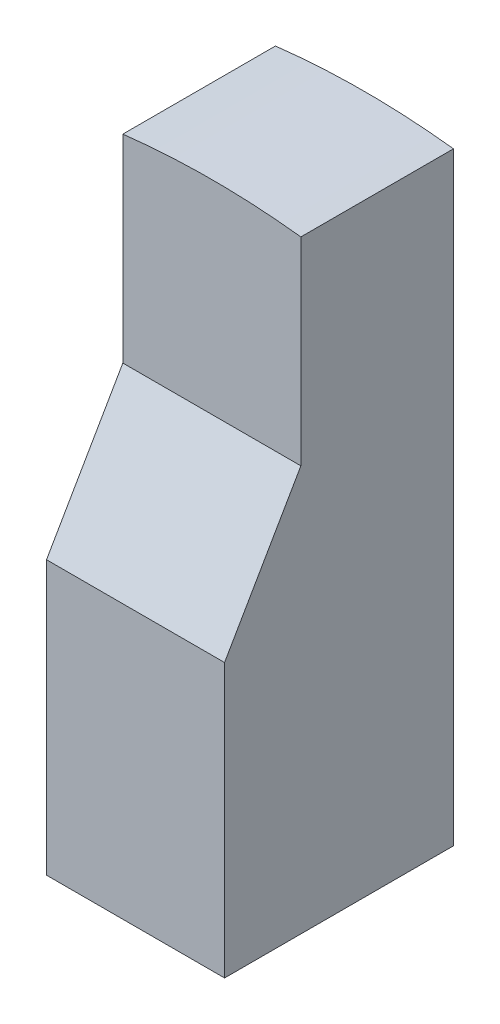
ISO-10303-21;
HEADER;
FILE_DESCRIPTION(('STEP AP214'),'2;1');
FILE_NAME('part.step','',(''),(''),'','','');
FILE_SCHEMA(('AUTOMOTIVE_DESIGN { 1 0 10303 214 1 1 1 1 }'));
ENDSEC;
DATA;
#1=APPLICATION_CONTEXT('core data for automotive mechanical design processes');
#2=APPLICATION_PROTOCOL_DEFINITION('international standard','automotive_design',2000,#1);
#3=PRODUCT_CONTEXT('',#1,'mechanical');
#4=PRODUCT('Part','Part','',(#3));
#5=PRODUCT_RELATED_PRODUCT_CATEGORY('part','',(#4));
#6=PRODUCT_DEFINITION_FORMATION('','',#4);
#7=PRODUCT_DEFINITION_CONTEXT('part definition',#1,'design');
#8=PRODUCT_DEFINITION('design','',#6,#7);
#9=PRODUCT_DEFINITION_SHAPE('','',#8);
#10=(LENGTH_UNIT() NAMED_UNIT(*) SI_UNIT(.MILLI.,.METRE.));
#11=(NAMED_UNIT(*) PLANE_ANGLE_UNIT() SI_UNIT($,.RADIAN.));
#12=(NAMED_UNIT(*) SI_UNIT($,.STERADIAN.) SOLID_ANGLE_UNIT());
#13=UNCERTAINTY_MEASURE_WITH_UNIT(LENGTH_MEASURE(1.E-05),#10,'distance_accuracy_value','');
#14=(GEOMETRIC_REPRESENTATION_CONTEXT(3) GLOBAL_UNCERTAINTY_ASSIGNED_CONTEXT((#13)) GLOBAL_UNIT_ASSIGNED_CONTEXT((#10,
#11,#12)) REPRESENTATION_CONTEXT('',''));
#15=CARTESIAN_POINT('',(0.,0.,0.));
#16=DIRECTION('',(0.,0.,1.));
#17=DIRECTION('',(1.,0.,0.));
#18=AXIS2_PLACEMENT_3D('',#15,#16,#17);
#19=CARTESIAN_POINT('',(0.,0.,22.5));
#20=DIRECTION('',(0.,0.,-1.));
#21=DIRECTION('',(-1.,0.,0.));
#22=AXIS2_PLACEMENT_3D('',#19,#20,#21);
#23=CYLINDRICAL_SURFACE('',#22,150.);
#24=CARTESIAN_POINT('',(0.,0.,7.49999999999998));
#25=DIRECTION('',(0.,0.,-1.));
#26=DIRECTION('',(0.,1.,0.));
#27=AXIS2_PLACEMENT_3D('',#24,#25,#26);
#28=CIRCLE('',#27,150.);
#29=CARTESIAN_POINT('',(-17.5,148.975669154396,7.5));
#30=VERTEX_POINT('',#29);
#31=CARTESIAN_POINT('',(17.5,148.975669154396,7.5));
#32=VERTEX_POINT('',#31);
#33=EDGE_CURVE('E83',#30,#32,#28,.T.);
#34=ORIENTED_EDGE('',*,*,#33,.T.);
#35=DIRECTION('',(0.,0.,-1.));
#36=VECTOR('',#35,1.);
#37=CARTESIAN_POINT('',(17.5,148.975669154396,22.5));
#38=LINE('',#37,#36);
#39=CARTESIAN_POINT('',(17.5,148.975669154396,-22.5));
#40=VERTEX_POINT('',#39);
#41=EDGE_CURVE('E76',#32,#40,#38,.T.);
#42=ORIENTED_EDGE('',*,*,#41,.T.);
#43=CARTESIAN_POINT('',(0.,0.,-22.5));
#44=DIRECTION('',(0.,0.,1.));
#45=DIRECTION('',(-1.,0.,0.));
#46=AXIS2_PLACEMENT_3D('',#43,#44,#45);
#47=CIRCLE('',#46,150.);
#48=CARTESIAN_POINT('',(-17.5,148.975669154396,-22.5));
#49=VERTEX_POINT('',#48);
#50=EDGE_CURVE('E80',#40,#49,#47,.T.);
#51=ORIENTED_EDGE('',*,*,#50,.T.);
#52=DIRECTION('',(0.,0.,-1.));
#53=VECTOR('',#52,1.);
#54=CARTESIAN_POINT('',(-17.5,148.975669154396,22.5));
#55=LINE('',#54,#53);
#56=EDGE_CURVE('E11',#30,#49,#55,.T.);
#57=ORIENTED_EDGE('',*,*,#56,.F.);
#58=EDGE_LOOP('',(#34,#42,#51,#57));
#59=FACE_BOUND('',#58,.T.);
#60=ADVANCED_FACE('F34',(#59),#23,.T.);
#61=CARTESIAN_POINT('',(-17.5,148.975669154396,22.5));
#62=DIRECTION('',(1.,0.,0.));
#63=DIRECTION('',(0.,1.,0.));
#64=AXIS2_PLACEMENT_3D('',#61,#62,#63);
#65=PLANE('',#64);
#66=DIRECTION('',(0.,0.866025403784442,-0.499999999999995));
#67=VECTOR('',#66,1.);
#68=CARTESIAN_POINT('',(-17.5,84.0192378864665,22.5));
#69=LINE('',#68,#67);
#70=CARTESIAN_POINT('',(-17.5,84.0192378864665,22.5));
#71=VERTEX_POINT('',#70);
#72=CARTESIAN_POINT('',(-17.5,110.,7.5));
#73=VERTEX_POINT('',#72);
#74=EDGE_CURVE('E48',#71,#73,#69,.T.);
#75=ORIENTED_EDGE('',*,*,#74,.T.);
#76=DIRECTION('',(0.,1.,0.));
#77=VECTOR('',#76,1.);
#78=CARTESIAN_POINT('',(-17.5,150.,7.5));
#79=LINE('',#78,#77);
#80=EDGE_CURVE('E120',#73,#30,#79,.T.);
#81=ORIENTED_EDGE('',*,*,#80,.T.);
#82=ORIENTED_EDGE('',*,*,#56,.T.);
#83=DIRECTION('',(0.,-1.,0.));
#84=VECTOR('',#83,1.);
#85=CARTESIAN_POINT('',(-17.5,148.975669154396,-22.5));
#86=LINE('',#85,#84);
#87=CARTESIAN_POINT('',(-17.5,30.31,-22.5));
#88=VERTEX_POINT('',#87);
#89=EDGE_CURVE('E102',#49,#88,#86,.T.);
#90=ORIENTED_EDGE('',*,*,#89,.T.);
#91=DIRECTION('',(0.,0.,-1.));
#92=VECTOR('',#91,1.);
#93=CARTESIAN_POINT('',(-17.5,30.31,22.5));
#94=LINE('',#93,#92);
#95=CARTESIAN_POINT('',(-17.5,30.31,22.5));
#96=VERTEX_POINT('',#95);
#97=EDGE_CURVE('E41',#96,#88,#94,.T.);
#98=ORIENTED_EDGE('',*,*,#97,.F.);
#99=DIRECTION('',(0.,-1.,0.));
#100=VECTOR('',#99,1.);
#101=CARTESIAN_POINT('',(-17.5,148.975669154396,22.5));
#102=LINE('',#101,#100);
#103=EDGE_CURVE('E97',#71,#96,#102,.T.);
#104=ORIENTED_EDGE('',*,*,#103,.F.);
#105=EDGE_LOOP('',(#75,#81,#82,#90,#98,#104));
#106=FACE_BOUND('',#105,.T.);
#107=ADVANCED_FACE('F117',(#106),#65,.F.);
#108=CARTESIAN_POINT('',(-17.5,30.31,22.5));
#109=DIRECTION('',(0.,1.,0.));
#110=DIRECTION('',(-1.,0.,0.));
#111=AXIS2_PLACEMENT_3D('',#108,#109,#110);
#112=PLANE('',#111);
#113=DIRECTION('',(1.,0.,0.));
#114=VECTOR('',#113,1.);
#115=CARTESIAN_POINT('',(-17.5,30.31,-22.5));
#116=LINE('',#115,#114);
#117=CARTESIAN_POINT('',(17.5,30.31,-22.5));
#118=VERTEX_POINT('',#117);
#119=EDGE_CURVE('E98',#88,#118,#116,.T.);
#120=ORIENTED_EDGE('',*,*,#119,.T.);
#121=DIRECTION('',(0.,0.,-1.));
#122=VECTOR('',#121,1.);
#123=CARTESIAN_POINT('',(17.5,30.31,22.5));
#124=LINE('',#123,#122);
#125=CARTESIAN_POINT('',(17.5,30.31,22.5));
#126=VERTEX_POINT('',#125);
#127=EDGE_CURVE('E87',#126,#118,#124,.T.);
#128=ORIENTED_EDGE('',*,*,#127,.F.);
#129=DIRECTION('',(1.,0.,0.));
#130=VECTOR('',#129,1.);
#131=CARTESIAN_POINT('',(-17.5,30.31,22.5));
#132=LINE('',#131,#130);
#133=EDGE_CURVE('E57',#96,#126,#132,.T.);
#134=ORIENTED_EDGE('',*,*,#133,.F.);
#135=ORIENTED_EDGE('',*,*,#97,.T.);
#136=EDGE_LOOP('',(#120,#128,#134,#135));
#137=FACE_BOUND('',#136,.T.);
#138=ADVANCED_FACE('F114',(#137),#112,.F.);
#139=CARTESIAN_POINT('',(17.5,148.975669154396,22.5));
#140=DIRECTION('',(-1.,0.,0.));
#141=DIRECTION('',(0.,-1.,0.));
#142=AXIS2_PLACEMENT_3D('',#139,#140,#141);
#143=PLANE('',#142);
#144=ORIENTED_EDGE('',*,*,#41,.F.);
#145=DIRECTION('',(0.,1.,0.));
#146=VECTOR('',#145,1.);
#147=CARTESIAN_POINT('',(17.5,150.,7.5));
#148=LINE('',#147,#146);
#149=CARTESIAN_POINT('',(17.5,110.,7.5));
#150=VERTEX_POINT('',#149);
#151=EDGE_CURVE('E138',#150,#32,#148,.T.);
#152=ORIENTED_EDGE('',*,*,#151,.F.);
#153=DIRECTION('',(0.,0.866025403784442,-0.499999999999995));
#154=VECTOR('',#153,1.);
#155=CARTESIAN_POINT('',(17.5,84.0192378864665,22.5));
#156=LINE('',#155,#154);
#157=CARTESIAN_POINT('',(17.5,84.0192378864665,22.5));
#158=VERTEX_POINT('',#157);
#159=EDGE_CURVE('E133',#158,#150,#156,.T.);
#160=ORIENTED_EDGE('',*,*,#159,.F.);
#161=DIRECTION('',(0.,1.,0.));
#162=VECTOR('',#161,1.);
#163=CARTESIAN_POINT('',(17.5,148.975669154396,22.5));
#164=LINE('',#163,#162);
#165=EDGE_CURVE('E88',#126,#158,#164,.T.);
#166=ORIENTED_EDGE('',*,*,#165,.F.);
#167=ORIENTED_EDGE('',*,*,#127,.T.);
#168=DIRECTION('',(0.,1.,0.));
#169=VECTOR('',#168,1.);
#170=CARTESIAN_POINT('',(17.5,148.975669154396,-22.5));
#171=LINE('',#170,#169);
#172=EDGE_CURVE('E92',#118,#40,#171,.T.);
#173=ORIENTED_EDGE('',*,*,#172,.T.);
#174=EDGE_LOOP('',(#144,#152,#160,#166,#167,#173));
#175=FACE_BOUND('',#174,.T.);
#176=ADVANCED_FACE('F93',(#175),#143,.F.);
#177=CARTESIAN_POINT('',(0.,0.,22.5));
#178=DIRECTION('',(0.,0.,-1.));
#179=DIRECTION('',(-1.,0.,0.));
#180=AXIS2_PLACEMENT_3D('',#177,#178,#179);
#181=PLANE('',#180);
#182=ORIENTED_EDGE('',*,*,#165,.T.);
#183=DIRECTION('',(1.,0.,0.));
#184=VECTOR('',#183,1.);
#185=CARTESIAN_POINT('',(-17.5,84.0192378864665,22.5));
#186=LINE('',#185,#184);
#187=EDGE_CURVE('E134',#71,#158,#186,.T.);
#188=ORIENTED_EDGE('',*,*,#187,.F.);
#189=ORIENTED_EDGE('',*,*,#103,.T.);
#190=ORIENTED_EDGE('',*,*,#133,.T.);
#191=EDGE_LOOP('',(#182,#188,#189,#190));
#192=FACE_BOUND('',#191,.T.);
#193=ADVANCED_FACE('F144',(#192),#181,.F.);
#194=CARTESIAN_POINT('',(0.,0.,-22.5));
#195=DIRECTION('',(0.,0.,-1.));
#196=DIRECTION('',(-1.,0.,0.));
#197=AXIS2_PLACEMENT_3D('',#194,#195,#196);
#198=PLANE('',#197);
#199=ORIENTED_EDGE('',*,*,#50,.F.);
#200=ORIENTED_EDGE('',*,*,#172,.F.);
#201=ORIENTED_EDGE('',*,*,#119,.F.);
#202=ORIENTED_EDGE('',*,*,#89,.F.);
#203=EDGE_LOOP('',(#199,#200,#201,#202));
#204=FACE_BOUND('',#203,.T.);
#205=ADVANCED_FACE('F101',(#204),#198,.T.);
#206=CARTESIAN_POINT('',(-17.5,150.,7.5));
#207=DIRECTION('',(0.,0.,-1.));
#208=DIRECTION('',(0.,1.,0.));
#209=AXIS2_PLACEMENT_3D('',#206,#207,#208);
#210=PLANE('',#209);
#211=ORIENTED_EDGE('',*,*,#33,.F.);
#212=ORIENTED_EDGE('',*,*,#80,.F.);
#213=DIRECTION('',(1.,0.,0.));
#214=VECTOR('',#213,1.);
#215=CARTESIAN_POINT('',(-17.5,110.,7.5));
#216=LINE('',#215,#214);
#217=EDGE_CURVE('E105',#73,#150,#216,.T.);
#218=ORIENTED_EDGE('',*,*,#217,.T.);
#219=ORIENTED_EDGE('',*,*,#151,.T.);
#220=EDGE_LOOP('',(#211,#212,#218,#219));
#221=FACE_BOUND('',#220,.T.);
#222=ADVANCED_FACE('F136',(#221),#210,.F.);
#223=CARTESIAN_POINT('',(-17.5,84.0192378864665,22.5));
#224=DIRECTION('',(0.,-0.499999999999995,-0.866025403784442));
#225=DIRECTION('',(0.,0.866025403784442,-0.499999999999995));
#226=AXIS2_PLACEMENT_3D('',#223,#224,#225);
#227=PLANE('',#226);
#228=ORIENTED_EDGE('',*,*,#159,.T.);
#229=ORIENTED_EDGE('',*,*,#217,.F.);
#230=ORIENTED_EDGE('',*,*,#74,.F.);
#231=ORIENTED_EDGE('',*,*,#187,.T.);
#232=EDGE_LOOP('',(#228,#229,#230,#231));
#233=FACE_BOUND('',#232,.T.);
#234=ADVANCED_FACE('F131',(#233),#227,.F.);
#235=CLOSED_SHELL('',(#60,#107,#138,#176,#193,#205,#222,#234));
#236=MANIFOLD_SOLID_BREP('B2',#235);
#237=ADVANCED_BREP_SHAPE_REPRESENTATION('',(#18,#236),#14);
#238=SHAPE_DEFINITION_REPRESENTATION(#9,#237);
ENDSEC;
END-ISO-10303-21;
